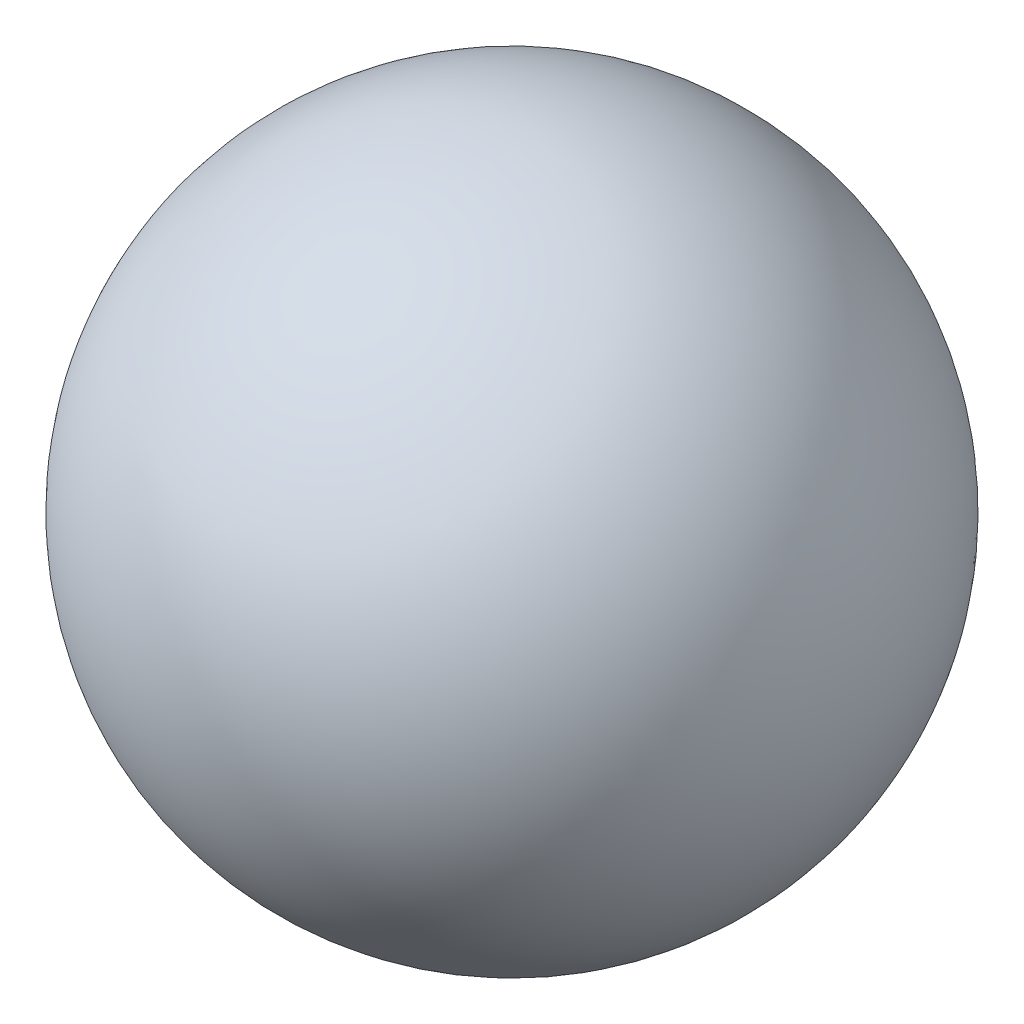
ISO-10303-21;
HEADER;
FILE_DESCRIPTION(('STEP AP214'),'2;1');
FILE_NAME('part.step','',(''),(''),'','','');
FILE_SCHEMA(('AUTOMOTIVE_DESIGN { 1 0 10303 214 1 1 1 1 }'));
ENDSEC;
DATA;
#1=APPLICATION_CONTEXT('core data for automotive mechanical design processes');
#2=APPLICATION_PROTOCOL_DEFINITION('international standard','automotive_design',2000,#1);
#3=PRODUCT_CONTEXT('',#1,'mechanical');
#4=PRODUCT('Part','Part','',(#3));
#5=PRODUCT_RELATED_PRODUCT_CATEGORY('part','',(#4));
#6=PRODUCT_DEFINITION_FORMATION('','',#4);
#7=PRODUCT_DEFINITION_CONTEXT('part definition',#1,'design');
#8=PRODUCT_DEFINITION('design','',#6,#7);
#9=PRODUCT_DEFINITION_SHAPE('','',#8);
#10=(LENGTH_UNIT() NAMED_UNIT(*) SI_UNIT(.MILLI.,.METRE.));
#11=(NAMED_UNIT(*) PLANE_ANGLE_UNIT() SI_UNIT($,.RADIAN.));
#12=(NAMED_UNIT(*) SI_UNIT($,.STERADIAN.) SOLID_ANGLE_UNIT());
#13=UNCERTAINTY_MEASURE_WITH_UNIT(LENGTH_MEASURE(1.E-05),#10,'distance_accuracy_value','');
#14=(GEOMETRIC_REPRESENTATION_CONTEXT(3) GLOBAL_UNCERTAINTY_ASSIGNED_CONTEXT((#13)) GLOBAL_UNIT_ASSIGNED_CONTEXT((#10,
#11,#12)) REPRESENTATION_CONTEXT('',''));
#15=CARTESIAN_POINT('',(0.,0.,0.));
#16=DIRECTION('',(0.,0.,1.));
#17=DIRECTION('',(1.,0.,0.));
#18=AXIS2_PLACEMENT_3D('',#15,#16,#17);
#19=CARTESIAN_POINT('',(0.,0.,0.));
#20=DIRECTION('',(0.,1.,0.));
#21=DIRECTION('',(0.,0.,1.));
#22=AXIS2_PLACEMENT_3D('',#19,#20,#21);
#23=PLANE('',#22);
#24=CARTESIAN_POINT('',(0.,0.,0.));
#25=DIRECTION('',(0.,1.,0.));
#26=DIRECTION('',(0.,0.,1.));
#27=AXIS2_PLACEMENT_3D('',#24,#25,#26);
#28=CIRCLE('',#27,4.);
#29=CARTESIAN_POINT('',(0.,0.,4.));
#30=VERTEX_POINT('',#29);
#31=EDGE_CURVE('E19',#30,#30,#28,.F.);
#32=ORIENTED_EDGE('',*,*,#31,.T.);
#33=EDGE_LOOP('',(#32));
#34=FACE_BOUND('',#33,.T.);
#35=ADVANCED_FACE('F16',(#34),#23,.F.);
#36=CARTESIAN_POINT('',(0.,0.,0.));
#37=DIRECTION('',(0.,1.,0.));
#38=DIRECTION('',(0.,0.,1.));
#39=AXIS2_PLACEMENT_3D('',#36,#37,#38);
#40=CYLINDRICAL_SURFACE('',#39,4.);
#41=ORIENTED_EDGE('',*,*,#31,.F.);
#42=EDGE_LOOP('',(#41));
#43=FACE_BOUND('',#42,.T.);
#44=CARTESIAN_POINT('',(0.,-14.4568322948,0.));
#45=DIRECTION('',(0.,1.,0.));
#46=DIRECTION('',(0.,0.,1.));
#47=AXIS2_PLACEMENT_3D('',#44,#45,#46);
#48=CIRCLE('',#47,4.);
#49=CARTESIAN_POINT('',(0.,-14.4568322948,4.));
#50=VERTEX_POINT('',#49);
#51=EDGE_CURVE('E11',#50,#50,#48,.T.);
#52=ORIENTED_EDGE('',*,*,#51,.F.);
#53=EDGE_LOOP('',(#52));
#54=FACE_BOUND('',#53,.T.);
#55=ADVANCED_FACE('F32',(#43,#54),#40,.F.);
#56=CARTESIAN_POINT('',(0.,0.,0.));
#57=DIRECTION('',(1.,0.,0.));
#58=DIRECTION('',(0.,0.,-1.));
#59=AXIS2_PLACEMENT_3D('',#56,#57,#58);
#60=SPHERICAL_SURFACE('',#59,15.);
#61=CARTESIAN_POINT('',(-15.,0.,0.));
#62=VERTEX_POINT('',#61);
#63=VERTEX_LOOP('',#62);
#64=FACE_BOUND('',#63,.T.);
#65=ORIENTED_EDGE('',*,*,#51,.T.);
#66=EDGE_LOOP('',(#65));
#67=FACE_BOUND('',#66,.T.);
#68=CARTESIAN_POINT('',(15.,0.,0.));
#69=VERTEX_POINT('',#68);
#70=VERTEX_LOOP('',#69);
#71=FACE_BOUND('',#70,.T.);
#72=ADVANCED_FACE('F29',(#64,#67,#71),#60,.T.);
#73=CLOSED_SHELL('',(#35,#55,#72));
#74=MANIFOLD_SOLID_BREP('B1',#73);
#75=ADVANCED_BREP_SHAPE_REPRESENTATION('',(#18,#74),#14);
#76=SHAPE_DEFINITION_REPRESENTATION(#9,#75);
ENDSEC;
END-ISO-10303-21;
